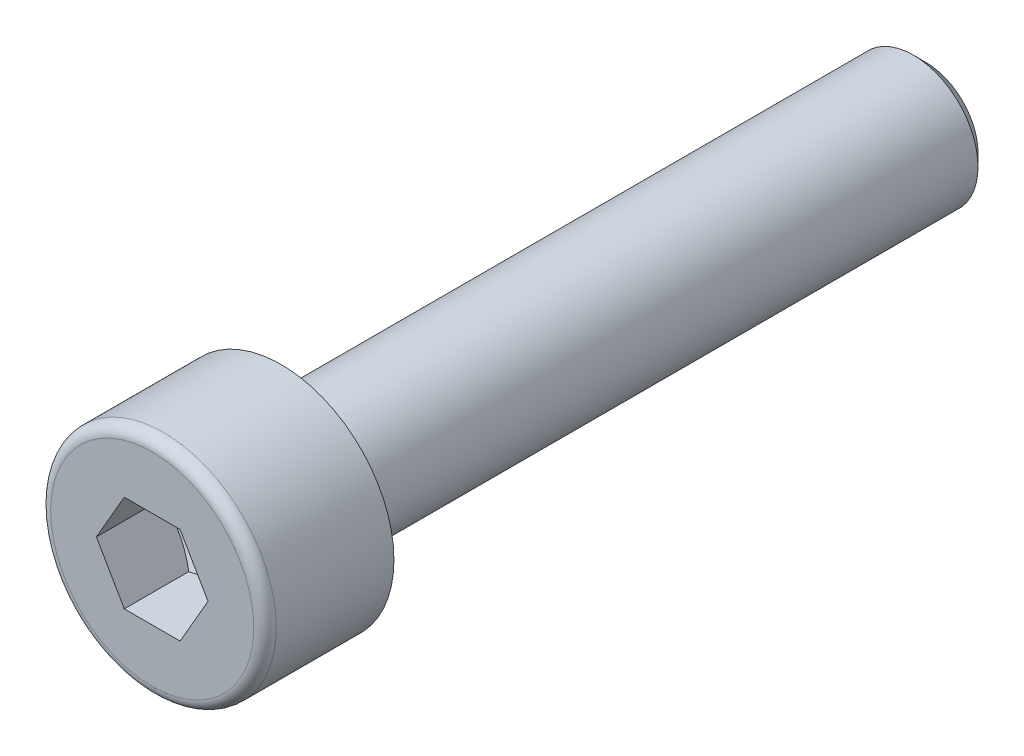
ISO-10303-21;
HEADER;
FILE_DESCRIPTION(('STEP AP214'),'2;1');
FILE_NAME('part.step','',(''),(''),'','','');
FILE_SCHEMA(('AUTOMOTIVE_DESIGN { 1 0 10303 214 1 1 1 1 }'));
ENDSEC;
DATA;
#1=APPLICATION_CONTEXT('core data for automotive mechanical design processes');
#2=APPLICATION_PROTOCOL_DEFINITION('international standard','automotive_design',2000,#1);
#3=PRODUCT_CONTEXT('',#1,'mechanical');
#4=PRODUCT('Part','Part','',(#3));
#5=PRODUCT_RELATED_PRODUCT_CATEGORY('part','',(#4));
#6=PRODUCT_DEFINITION_FORMATION('','',#4);
#7=PRODUCT_DEFINITION_CONTEXT('part definition',#1,'design');
#8=PRODUCT_DEFINITION('design','',#6,#7);
#9=PRODUCT_DEFINITION_SHAPE('','',#8);
#10=(LENGTH_UNIT() NAMED_UNIT(*) SI_UNIT(.MILLI.,.METRE.));
#11=(NAMED_UNIT(*) PLANE_ANGLE_UNIT() SI_UNIT($,.RADIAN.));
#12=(NAMED_UNIT(*) SI_UNIT($,.STERADIAN.) SOLID_ANGLE_UNIT());
#13=UNCERTAINTY_MEASURE_WITH_UNIT(LENGTH_MEASURE(1.E-05),#10,'distance_accuracy_value','');
#14=(GEOMETRIC_REPRESENTATION_CONTEXT(3) GLOBAL_UNCERTAINTY_ASSIGNED_CONTEXT((#13)) GLOBAL_UNIT_ASSIGNED_CONTEXT((#10,
#11,#12)) REPRESENTATION_CONTEXT('',''));
#15=CARTESIAN_POINT('',(0.,0.,0.));
#16=DIRECTION('',(0.,0.,1.));
#17=DIRECTION('',(1.,0.,0.));
#18=AXIS2_PLACEMENT_3D('',#15,#16,#17);
#19=CARTESIAN_POINT('',(0.,0.,0.));
#20=DIRECTION('',(0.,0.,1.));
#21=DIRECTION('',(1.,0.,0.));
#22=AXIS2_PLACEMENT_3D('',#19,#20,#21);
#23=PLANE('',#22);
#24=CARTESIAN_POINT('',(0.,0.,0.));
#25=DIRECTION('',(0.,0.,1.));
#26=DIRECTION('',(1.,0.,0.));
#27=AXIS2_PLACEMENT_3D('',#24,#25,#26);
#28=CIRCLE('',#27,3.5);
#29=CARTESIAN_POINT('',(3.5,0.,0.));
#30=VERTEX_POINT('',#29);
#31=EDGE_CURVE('E146',#30,#30,#28,.T.);
#32=ORIENTED_EDGE('',*,*,#31,.F.);
#33=EDGE_LOOP('',(#32));
#34=FACE_BOUND('',#33,.T.);
#35=CARTESIAN_POINT('',(0.,0.,0.));
#36=DIRECTION('',(0.,0.,1.));
#37=DIRECTION('',(1.,0.,0.));
#38=AXIS2_PLACEMENT_3D('',#35,#36,#37);
#39=CIRCLE('',#38,2.);
#40=CARTESIAN_POINT('',(2.,0.,0.));
#41=VERTEX_POINT('',#40);
#42=EDGE_CURVE('E151',#41,#41,#39,.F.);
#43=ORIENTED_EDGE('',*,*,#42,.F.);
#44=EDGE_LOOP('',(#43));
#45=FACE_BOUND('',#44,.T.);
#46=ADVANCED_FACE('F43',(#34,#45),#23,.F.);
#47=CARTESIAN_POINT('',(0.,3.15,4.));
#48=DIRECTION('',(0.,0.,-1.));
#49=DIRECTION('',(-1.,0.,0.));
#50=AXIS2_PLACEMENT_3D('',#47,#48,#49);
#51=PLANE('',#50);
#52=CARTESIAN_POINT('',(0.,0.,4.));
#53=DIRECTION('',(0.,0.,-1.));
#54=DIRECTION('',(-1.,0.,0.));
#55=AXIS2_PLACEMENT_3D('',#52,#53,#54);
#56=CIRCLE('',#55,3.15);
#57=CARTESIAN_POINT('',(-3.15,0.,4.));
#58=VERTEX_POINT('',#57);
#59=EDGE_CURVE('E51',#58,#58,#56,.F.);
#60=ORIENTED_EDGE('',*,*,#59,.T.);
#61=EDGE_LOOP('',(#60));
#62=FACE_BOUND('',#61,.T.);
#63=DIRECTION('',(0.5,-0.866025403784438,0.));
#64=VECTOR('',#63,1.);
#65=CARTESIAN_POINT('',(0.866025,1.49999930062484,4.));
#66=LINE('',#65,#64);
#67=CARTESIAN_POINT('',(0.866025,1.49999930062484,4.));
#68=VERTEX_POINT('',#67);
#69=CARTESIAN_POINT('',(1.73205,0.,4.));
#70=VERTEX_POINT('',#69);
#71=EDGE_CURVE('E58',#68,#70,#66,.T.);
#72=ORIENTED_EDGE('',*,*,#71,.T.);
#73=DIRECTION('',(-0.5,-0.866025403784439,0.));
#74=VECTOR('',#73,1.);
#75=CARTESIAN_POINT('',(1.73205,0.,4.));
#76=LINE('',#75,#74);
#77=CARTESIAN_POINT('',(0.866025,-1.49999930062484,4.));
#78=VERTEX_POINT('',#77);
#79=EDGE_CURVE('E175',#70,#78,#76,.T.);
#80=ORIENTED_EDGE('',*,*,#79,.T.);
#81=DIRECTION('',(-1.,0.,0.));
#82=VECTOR('',#81,1.);
#83=CARTESIAN_POINT('',(0.866025,-1.49999930062484,4.));
#84=LINE('',#83,#82);
#85=CARTESIAN_POINT('',(-0.866025,-1.49999930062484,4.));
#86=VERTEX_POINT('',#85);
#87=EDGE_CURVE('E271',#78,#86,#84,.T.);
#88=ORIENTED_EDGE('',*,*,#87,.T.);
#89=DIRECTION('',(-0.5,0.866025403784439,0.));
#90=VECTOR('',#89,1.);
#91=CARTESIAN_POINT('',(-0.866025,-1.49999930062484,4.));
#92=LINE('',#91,#90);
#93=CARTESIAN_POINT('',(-1.73205,0.,4.));
#94=VERTEX_POINT('',#93);
#95=EDGE_CURVE('E275',#86,#94,#92,.T.);
#96=ORIENTED_EDGE('',*,*,#95,.T.);
#97=DIRECTION('',(0.5,0.866025403784439,0.));
#98=VECTOR('',#97,1.);
#99=CARTESIAN_POINT('',(-1.73205,0.,4.));
#100=LINE('',#99,#98);
#101=CARTESIAN_POINT('',(-0.866025,1.49999930062484,4.));
#102=VERTEX_POINT('',#101);
#103=EDGE_CURVE('E130',#94,#102,#100,.T.);
#104=ORIENTED_EDGE('',*,*,#103,.T.);
#105=DIRECTION('',(1.,0.,0.));
#106=VECTOR('',#105,1.);
#107=CARTESIAN_POINT('',(-0.866025,1.49999930062484,4.));
#108=LINE('',#107,#106);
#109=EDGE_CURVE('E122',#102,#68,#108,.T.);
#110=ORIENTED_EDGE('',*,*,#109,.T.);
#111=EDGE_LOOP('',(#72,#80,#88,#96,#104,#110));
#112=FACE_BOUND('',#111,.T.);
#113=ADVANCED_FACE('F230',(#62,#112),#51,.F.);
#114=CARTESIAN_POINT('',(0.,0.,4.));
#115=DIRECTION('',(0.,0.,1.));
#116=DIRECTION('',(1.,0.,0.));
#117=AXIS2_PLACEMENT_3D('',#114,#115,#116);
#118=CYLINDRICAL_SURFACE('',#117,3.5);
#119=CARTESIAN_POINT('',(0.,0.,3.65));
#120=DIRECTION('',(0.,0.,-1.));
#121=DIRECTION('',(-1.,0.,0.));
#122=AXIS2_PLACEMENT_3D('',#119,#120,#121);
#123=CIRCLE('',#122,3.5);
#124=CARTESIAN_POINT('',(-3.5,0.,3.65));
#125=VERTEX_POINT('',#124);
#126=EDGE_CURVE('E12',#125,#125,#123,.T.);
#127=ORIENTED_EDGE('',*,*,#126,.T.);
#128=EDGE_LOOP('',(#127));
#129=FACE_BOUND('',#128,.T.);
#130=ORIENTED_EDGE('',*,*,#31,.T.);
#131=EDGE_LOOP('',(#130));
#132=FACE_BOUND('',#131,.T.);
#133=ADVANCED_FACE('F228',(#129,#132),#118,.T.);
#134=CARTESIAN_POINT('',(0.866025,1.49999930062484,1.00000046625011));
#135=DIRECTION('',(-0.866025403784438,-0.5,0.));
#136=DIRECTION('',(-0.5,0.866025403784438,0.));
#137=AXIS2_PLACEMENT_3D('',#134,#135,#136);
#138=PLANE('',#137);
#139=DIRECTION('',(0.,0.,1.));
#140=VECTOR('',#139,1.);
#141=CARTESIAN_POINT('',(1.73205,0.,1.00000046625011));
#142=LINE('',#141,#140);
#143=CARTESIAN_POINT('',(1.73205,0.,2.));
#144=VERTEX_POINT('',#143);
#145=EDGE_CURVE('E143',#144,#70,#142,.T.);
#146=ORIENTED_EDGE('',*,*,#145,.T.);
#147=ORIENTED_EDGE('',*,*,#71,.F.);
#148=DIRECTION('',(0.,0.,1.));
#149=VECTOR('',#148,1.);
#150=CARTESIAN_POINT('',(0.866025,1.49999930062484,1.00000046625011));
#151=LINE('',#150,#149);
#152=CARTESIAN_POINT('',(0.866025,1.49999930062484,2.));
#153=VERTEX_POINT('',#152);
#154=EDGE_CURVE('E115',#153,#68,#151,.T.);
#155=ORIENTED_EDGE('',*,*,#154,.F.);
#156=CARTESIAN_POINT('',(1.73205115470054,-2.E-06,2.00000066666734));
#157=CARTESIAN_POINT('',(1.69399458130122,0.0659139186895892,1.97802228100261));
#158=CARTESIAN_POINT('',(1.65560950414464,0.132398822577242,1.95803408114054));
#159=CARTESIAN_POINT('',(1.57817473630843,0.266519774741864,1.92314525941874));
#160=CARTESIAN_POINT('',(1.53912367019894,0.334158205333232,1.90825697858766));
#161=CARTESIAN_POINT('',(1.46150547885139,0.468596856338784,1.88508226983918));
#162=CARTESIAN_POINT('',(1.42295029290091,0.535376397300293,1.87664158385231));
#163=CARTESIAN_POINT('',(1.34565859846878,0.669249539059823,1.86656700525616));
#164=CARTESIAN_POINT('',(1.30692237073331,0.736342653591208,1.86492476807133));
#165=CARTESIAN_POINT('',(1.23454773253413,0.861699204131607,1.86834969801067));
#166=CARTESIAN_POINT('',(1.20089846229767,0.919981449818777,1.87257593125167));
#167=CARTESIAN_POINT('',(1.1338191361032,1.03616625092508,1.88596796669928));
#168=CARTESIAN_POINT('',(1.10038931198579,1.09406840478452,1.89513833923059));
#169=CARTESIAN_POINT('',(1.03317179328088,1.21049256234014,1.91806252128818));
#170=CARTESIAN_POINT('',(0.999392601793287,1.26899983823525,1.93191346069662));
#171=CARTESIAN_POINT('',(0.932337893068965,1.38514200063251,1.96334924731355));
#172=CARTESIAN_POINT('',(0.89906151743008,1.4427783739308,1.980926712986));
#173=CARTESIAN_POINT('',(0.866023845299461,1.50000130062484,2.00000066666734));
#174=B_SPLINE_CURVE_WITH_KNOTS('',3,(#156,#157,#158,#159,#160,#161,#162,#163,#164,#165,#166,
#167,#168,#169,#170,#171,#172,#173),.UNSPECIFIED.,.F.,.F.,(4,2,2,2,2,2,2,2,4),(0.,
0.237762055931485,0.476095461361748,0.708530837844131,0.94068083294838,1.14278193102308,
1.34507017093339,1.55184422617205,1.75821246569164),.UNSPECIFIED.);
#175=EDGE_CURVE('E107',#144,#153,#174,.T.);
#176=ORIENTED_EDGE('',*,*,#175,.F.);
#177=EDGE_LOOP('',(#146,#147,#155,#176));
#178=FACE_BOUND('',#177,.T.);
#179=ADVANCED_FACE('F116',(#178),#138,.T.);
#180=CARTESIAN_POINT('',(1.73205,0.,1.00000046625011));
#181=DIRECTION('',(-0.866025403784439,0.5,0.));
#182=DIRECTION('',(0.5,0.866025403784439,0.));
#183=AXIS2_PLACEMENT_3D('',#180,#181,#182);
#184=PLANE('',#183);
#185=DIRECTION('',(0.,0.,1.));
#186=VECTOR('',#185,1.);
#187=CARTESIAN_POINT('',(0.866025,-1.49999930062484,1.00000046625011));
#188=LINE('',#187,#186);
#189=CARTESIAN_POINT('',(0.866025,-1.49999930062484,2.));
#190=VERTEX_POINT('',#189);
#191=EDGE_CURVE('E140',#190,#78,#188,.T.);
#192=ORIENTED_EDGE('',*,*,#191,.T.);
#193=ORIENTED_EDGE('',*,*,#79,.F.);
#194=ORIENTED_EDGE('',*,*,#145,.F.);
#195=CARTESIAN_POINT('',(0.866023845299462,-1.50000130062484,2.00000066666734));
#196=CARTESIAN_POINT('',(0.904080418698778,-1.43408538193525,1.9780222810026));
#197=CARTESIAN_POINT('',(0.942465495855361,-1.36760047804759,1.95803408114054));
#198=CARTESIAN_POINT('',(1.01990026369157,-1.23347952588297,1.92314525941874));
#199=CARTESIAN_POINT('',(1.05895132980106,-1.1658410952916,1.90825697858766));
#200=CARTESIAN_POINT('',(1.13656952114861,-1.03140244428605,1.88508226983918));
#201=CARTESIAN_POINT('',(1.1751247070991,-0.964622903324544,1.87664158385231));
#202=CARTESIAN_POINT('',(1.25241640153122,-0.830749761565014,1.86656700525616));
#203=CARTESIAN_POINT('',(1.29115262926669,-0.763656647033629,1.86492476807133));
#204=CARTESIAN_POINT('',(1.36352726746587,-0.638300096493229,1.86834969801067));
#205=CARTESIAN_POINT('',(1.39717653770233,-0.58001785080606,1.87257593125166));
#206=CARTESIAN_POINT('',(1.4642558638968,-0.463833049699756,1.88596796669928));
#207=CARTESIAN_POINT('',(1.49768568801421,-0.405930895840313,1.89513833923059));
#208=CARTESIAN_POINT('',(1.56490320671912,-0.2895067382847,1.91806252128818));
#209=CARTESIAN_POINT('',(1.59868239820671,-0.230999462389588,1.93191346069662));
#210=CARTESIAN_POINT('',(1.66573710693103,-0.11485729999233,1.96334924731355));
#211=CARTESIAN_POINT('',(1.69901348256992,-0.0572209266940348,1.980926712986));
#212=CARTESIAN_POINT('',(1.73205115470054,1.99999999979098E-06,2.00000066666734));
#213=B_SPLINE_CURVE_WITH_KNOTS('',3,(#195,#196,#197,#198,#199,#200,#201,#202,#203,#204,#205,
#206,#207,#208,#209,#210,#211,#212),.UNSPECIFIED.,.F.,.F.,(4,2,2,2,2,2,2,2,4),(0.,
0.237762055931484,0.476095461361747,0.708530837844129,0.940680832948377,1.14278193102307,
1.34507017093338,1.55184422617205,1.75821246569164),.UNSPECIFIED.);
#214=EDGE_CURVE('E111',#190,#144,#213,.T.);
#215=ORIENTED_EDGE('',*,*,#214,.F.);
#216=EDGE_LOOP('',(#192,#193,#194,#215));
#217=FACE_BOUND('',#216,.T.);
#218=ADVANCED_FACE('F219',(#217),#184,.T.);
#219=CARTESIAN_POINT('',(0.866025,-1.49999930062484,1.00000046625011));
#220=DIRECTION('',(0.,1.,0.));
#221=DIRECTION('',(1.,0.,0.));
#222=AXIS2_PLACEMENT_3D('',#219,#220,#221);
#223=PLANE('',#222);
#224=DIRECTION('',(0.,0.,1.));
#225=VECTOR('',#224,1.);
#226=CARTESIAN_POINT('',(-0.866025,-1.49999930062484,1.00000046625011));
#227=LINE('',#226,#225);
#228=CARTESIAN_POINT('',(-0.866025,-1.49999930062484,2.));
#229=VERTEX_POINT('',#228);
#230=EDGE_CURVE('E137',#229,#86,#227,.T.);
#231=ORIENTED_EDGE('',*,*,#230,.T.);
#232=ORIENTED_EDGE('',*,*,#87,.F.);
#233=ORIENTED_EDGE('',*,*,#191,.F.);
#234=CARTESIAN_POINT('',(-2.24271663728987,-1.49999930062484,2.55775267344395));
#235=CARTESIAN_POINT('',(-2.17794141332338,-1.49999930062484,2.52667596135368));
#236=CARTESIAN_POINT('',(-2.11300852130655,-1.49999930062484,2.49592211621229));
#237=CARTESIAN_POINT('',(-1.98274303131292,-1.49999930062484,2.43524311162405));
#238=CARTESIAN_POINT('',(-1.91741036395219,-1.49999930062484,2.40531810131238));
#239=CARTESIAN_POINT('',(-1.78588635397686,-1.49999930062484,2.34631254095844));
#240=CARTESIAN_POINT('',(-1.71969220663993,-1.49999930062484,2.31723821458641));
#241=CARTESIAN_POINT('',(-1.58674953026847,-1.49999930062484,2.26039396688304));
#242=CARTESIAN_POINT('',(-1.52000103027226,-1.49999930062484,2.23262397772829));
#243=CARTESIAN_POINT('',(-1.38408036083489,-1.49999930062484,2.17802545642731));
#244=CARTESIAN_POINT('',(-1.31489044686774,-1.49999930062484,2.1512405113674));
#245=CARTESIAN_POINT('',(-1.17568875836751,-1.49999930062484,2.09990652822181));
#246=CARTESIAN_POINT('',(-1.10567688208708,-1.49999930062484,2.07535777031023));
#247=CARTESIAN_POINT('',(-0.894522216300188,-1.49999930062484,2.0061010834001));
#248=CARTESIAN_POINT('',(-0.751873977094198,-1.49999930062484,1.9656202744164));
#249=CARTESIAN_POINT('',(-0.535047450977606,-1.49999930062484,1.9186645261203));
#250=CARTESIAN_POINT('',(-0.462365424606466,-1.49999930062484,1.90531291688069));
#251=CARTESIAN_POINT('',(-0.316183762847225,-1.49999930062484,1.8841134767258));
#252=CARTESIAN_POINT('',(-0.242684183051902,-1.49999930062484,1.87626527388084));
#253=CARTESIAN_POINT('',(-0.0961588910059515,-1.49999930062484,1.86679859934064));
#254=CARTESIAN_POINT('',(-0.0231380525234333,-1.49999930062484,1.86510661239957));
#255=CARTESIAN_POINT('',(0.122783022434076,-1.49999930062484,1.86789948707645));
#256=CARTESIAN_POINT('',(0.195683251161583,-1.49999930062484,1.8723847311637));
#257=CARTESIAN_POINT('',(0.375553746438775,-1.49999930062484,1.89067768491976));
#258=CARTESIAN_POINT('',(0.4821754471692,-1.49999930062484,1.90791354190592));
#259=CARTESIAN_POINT('',(0.693345462539466,-1.49999930062484,1.95235984396466));
#260=CARTESIAN_POINT('',(0.79789111749796,-1.49999930062484,1.97958231080908));
#261=CARTESIAN_POINT('',(0.954250638010105,-1.49999930062484,2.02608493590371));
#262=CARTESIAN_POINT('',(1.00687274480645,-1.49999930062484,2.04274751774646));
#263=CARTESIAN_POINT('',(1.11156919647057,-1.49999930062484,2.07761406562061));
#264=CARTESIAN_POINT('',(1.16364386068557,-1.49999930062484,2.09581706970924));
#265=CARTESIAN_POINT('',(1.26731501755411,-1.49999930062484,2.13350010092581));
#266=CARTESIAN_POINT('',(1.31891159517315,-1.49999930062484,2.15297989597396));
#267=CARTESIAN_POINT('',(1.42169818698628,-1.49999930062484,2.19300580386973));
#268=CARTESIAN_POINT('',(1.47288813079445,-1.49999930062484,2.21355209687612));
#269=CARTESIAN_POINT('',(1.6035520536722,-1.49999930062484,2.26731329701247));
#270=CARTESIAN_POINT('',(1.68276476914258,-1.49999930062484,2.30116251352867));
#271=CARTESIAN_POINT('',(1.84047488481565,-1.49999930062484,2.37049266735));
#272=CARTESIAN_POINT('',(1.9189722309026,-1.49999930062484,2.40597372689195));
#273=CARTESIAN_POINT('',(2.15362957255391,-1.49999930062484,2.51428942992019));
#274=CARTESIAN_POINT('',(2.3089286607519,-1.49999930062484,2.58898549353906));
#275=CARTESIAN_POINT('',(2.61820006623532,-1.49999930062484,2.74151036059574));
#276=CARTESIAN_POINT('',(2.77217051778771,-1.49999930062484,2.81934290231597));
#277=CARTESIAN_POINT('',(3.07905650209162,-1.49999930062484,2.97700931547993));
#278=CARTESIAN_POINT('',(3.23197216581148,-1.49999930062484,3.05684293253984));
#279=CARTESIAN_POINT('',(3.52267476728495,-1.49999930062484,3.21028853935711));
#280=CARTESIAN_POINT('',(3.66052737206612,-1.49999930062484,3.28377655462836));
#281=CARTESIAN_POINT('',(3.93578914881928,-1.49999930062484,3.43158990958268));
#282=CARTESIAN_POINT('',(4.07319830413762,-1.49999930062484,3.50591528025237));
#283=CARTESIAN_POINT('',(4.34732590427536,-1.49999930062483,3.65500351537988));
#284=CARTESIAN_POINT('',(4.48404521696312,-1.49999930062483,3.72976478622522));
#285=CARTESIAN_POINT('',(4.75720742747683,-1.49999930062483,3.87977391809883));
#286=CARTESIAN_POINT('',(4.89365033939364,-1.49999930062484,3.9550217534582));
#287=CARTESIAN_POINT('',(5.02999394665514,-1.49999930062484,4.03044801324502));
#288=B_SPLINE_CURVE_WITH_KNOTS('',3,(#234,#235,#236,#237,#238,#239,#240,#241,#242,#243,#244,
#245,#246,#247,#248,#249,#250,#251,#252,#253,#254,#255,#256,#257,#258,#259,#260,#261,#262,#263,
#264,#265,#266,#267,#268,#269,#270,#271,#272,#273,#274,#275,#276,#277,#278,#279,#280,#281,#282,
#283,#284,#285,#286,#287),.UNSPECIFIED.,.F.,.F.,(4,2,2,2,2,2,2,2,2,2,2,2,2,2,2,2,2,2,2,2,2,2,2,
2,2,2,4),(0.,0.215535408976475,0.431109351318747,0.647990972858705,0.864861304394723,
1.08740082372431,1.30996818700982,1.75384735851117,1.97537373294937,2.19688513480997,
2.41574248382684,2.63461338422016,2.95796620171825,3.28170955197757,3.44728283297626,
3.61275347131505,3.77819411534645,3.94366279806486,4.20206179692704,4.46048018336434,
4.97740230798824,5.49495989978084,6.01245202818902,6.48110050133562,6.94976637432356,
7.41724019162004,7.88468954517039),.UNSPECIFIED.);
#289=EDGE_CURVE('E208',#229,#190,#288,.T.);
#290=ORIENTED_EDGE('',*,*,#289,.F.);
#291=EDGE_LOOP('',(#231,#232,#233,#290));
#292=FACE_BOUND('',#291,.T.);
#293=ADVANCED_FACE('F215',(#292),#223,.T.);
#294=CARTESIAN_POINT('',(-0.866025,-1.49999930062484,1.00000046625011));
#295=DIRECTION('',(0.866025403784439,0.5,0.));
#296=DIRECTION('',(0.5,-0.866025403784439,0.));
#297=AXIS2_PLACEMENT_3D('',#294,#295,#296);
#298=PLANE('',#297);
#299=DIRECTION('',(0.,0.,1.));
#300=VECTOR('',#299,1.);
#301=CARTESIAN_POINT('',(-1.73205,0.,1.00000046625011));
#302=LINE('',#301,#300);
#303=CARTESIAN_POINT('',(-1.73205,0.,2.));
#304=VERTEX_POINT('',#303);
#305=EDGE_CURVE('E128',#304,#94,#302,.T.);
#306=ORIENTED_EDGE('',*,*,#305,.T.);
#307=ORIENTED_EDGE('',*,*,#95,.F.);
#308=ORIENTED_EDGE('',*,*,#230,.F.);
#309=CARTESIAN_POINT('',(-1.73205115470054,1.99999999935948E-06,2.00000066666734));
#310=CARTESIAN_POINT('',(-1.69399458130122,-0.0659139186895897,1.97802228100261));
#311=CARTESIAN_POINT('',(-1.65560950414464,-0.132398822577242,1.95803408114054));
#312=CARTESIAN_POINT('',(-1.57817473630843,-0.266519774741865,1.92314525941874));
#313=CARTESIAN_POINT('',(-1.53912367019894,-0.334158205333233,1.90825697858766));
#314=CARTESIAN_POINT('',(-1.46150547885139,-0.468596856338785,1.88508226983918));
#315=CARTESIAN_POINT('',(-1.4229502929009,-0.535376397300293,1.87664158385231));
#316=CARTESIAN_POINT('',(-1.34565859846878,-0.669249539059823,1.86656700525616));
#317=CARTESIAN_POINT('',(-1.30692237073331,-0.736342653591209,1.86492476807133));
#318=CARTESIAN_POINT('',(-1.23454773253413,-0.861699204131608,1.86834969801067));
#319=CARTESIAN_POINT('',(-1.20089846229767,-0.919981449818777,1.87257593125166));
#320=CARTESIAN_POINT('',(-1.1338191361032,-1.03616625092508,1.88596796669928));
#321=CARTESIAN_POINT('',(-1.10038931198579,-1.09406840478452,1.89513833923059));
#322=CARTESIAN_POINT('',(-1.03317179328088,-1.21049256234014,1.91806252128818));
#323=CARTESIAN_POINT('',(-0.999392601793289,-1.26899983823525,1.93191346069662));
#324=CARTESIAN_POINT('',(-0.932337893068967,-1.38514200063251,1.96334924731355));
#325=CARTESIAN_POINT('',(-0.899061517430081,-1.4427783739308,1.980926712986));
#326=CARTESIAN_POINT('',(-0.866023845299461,-1.50000130062484,2.00000066666734));
#327=B_SPLINE_CURVE_WITH_KNOTS('',3,(#309,#310,#311,#312,#313,#314,#315,#316,#317,#318,#319,
#320,#321,#322,#323,#324,#325,#326),.UNSPECIFIED.,.F.,.F.,(4,2,2,2,2,2,2,2,4),(0.,
0.237762055931485,0.476095461361749,0.708530837844132,0.94068083294838,1.14278193102308,
1.34507017093338,1.55184422617205,1.75821246569164),.UNSPECIFIED.);
#328=EDGE_CURVE('E202',#304,#229,#327,.T.);
#329=ORIENTED_EDGE('',*,*,#328,.F.);
#330=EDGE_LOOP('',(#306,#307,#308,#329));
#331=FACE_BOUND('',#330,.T.);
#332=ADVANCED_FACE('F218',(#331),#298,.T.);
#333=CARTESIAN_POINT('',(-1.73205,0.,1.00000046625011));
#334=DIRECTION('',(0.866025403784439,-0.5,0.));
#335=DIRECTION('',(-0.5,-0.866025403784439,0.));
#336=AXIS2_PLACEMENT_3D('',#333,#334,#335);
#337=PLANE('',#336);
#338=DIRECTION('',(0.,0.,1.));
#339=VECTOR('',#338,1.);
#340=CARTESIAN_POINT('',(-0.866025,1.49999930062484,1.00000046625011));
#341=LINE('',#340,#339);
#342=CARTESIAN_POINT('',(-0.866025,1.49999930062484,2.));
#343=VERTEX_POINT('',#342);
#344=EDGE_CURVE('E121',#343,#102,#341,.T.);
#345=ORIENTED_EDGE('',*,*,#344,.T.);
#346=ORIENTED_EDGE('',*,*,#103,.F.);
#347=ORIENTED_EDGE('',*,*,#305,.F.);
#348=CARTESIAN_POINT('',(-0.866023845299462,1.50000130062484,2.00000066666734));
#349=CARTESIAN_POINT('',(-0.904080418698778,1.43408538193525,1.9780222810026));
#350=CARTESIAN_POINT('',(-0.942465495855361,1.36760047804759,1.95803408114054));
#351=CARTESIAN_POINT('',(-1.01990026369157,1.23347952588297,1.92314525941874));
#352=CARTESIAN_POINT('',(-1.05895132980106,1.1658410952916,1.90825697858766));
#353=CARTESIAN_POINT('',(-1.13656952114861,1.03140244428605,1.88508226983918));
#354=CARTESIAN_POINT('',(-1.1751247070991,0.964622903324544,1.87664158385231));
#355=CARTESIAN_POINT('',(-1.25241640153122,0.830749761565014,1.86656700525616));
#356=CARTESIAN_POINT('',(-1.29115262926669,0.763656647033629,1.86492476807133));
#357=CARTESIAN_POINT('',(-1.36352726746587,0.638300096493229,1.86834969801067));
#358=CARTESIAN_POINT('',(-1.39717653770233,0.58001785080606,1.87257593125166));
#359=CARTESIAN_POINT('',(-1.4642558638968,0.463833049699756,1.88596796669928));
#360=CARTESIAN_POINT('',(-1.49768568801421,0.405930895840313,1.89513833923059));
#361=CARTESIAN_POINT('',(-1.56490320671912,0.289506738284699,1.91806252128818));
#362=CARTESIAN_POINT('',(-1.59868239820671,0.230999462389588,1.93191346069662));
#363=CARTESIAN_POINT('',(-1.66573710693103,0.11485729999233,1.96334924731355));
#364=CARTESIAN_POINT('',(-1.69901348256992,0.0572209266940344,1.980926712986));
#365=CARTESIAN_POINT('',(-1.73205115470054,-2.00000000048508E-06,2.00000066666734));
#366=B_SPLINE_CURVE_WITH_KNOTS('',3,(#348,#349,#350,#351,#352,#353,#354,#355,#356,#357,#358,
#359,#360,#361,#362,#363,#364,#365),.UNSPECIFIED.,.F.,.F.,(4,2,2,2,2,2,2,2,4),(0.,
0.237762055931484,0.476095461361747,0.708530837844129,0.940680832948377,1.14278193102307,
1.34507017093338,1.55184422617205,1.75821246569164),.UNSPECIFIED.);
#367=EDGE_CURVE('E66',#343,#304,#366,.T.);
#368=ORIENTED_EDGE('',*,*,#367,.F.);
#369=EDGE_LOOP('',(#345,#346,#347,#368));
#370=FACE_BOUND('',#369,.T.);
#371=ADVANCED_FACE('F297',(#370),#337,.T.);
#372=CARTESIAN_POINT('',(-0.866025,1.49999930062484,1.00000046625011));
#373=DIRECTION('',(0.,-1.,0.));
#374=DIRECTION('',(-1.,0.,0.));
#375=AXIS2_PLACEMENT_3D('',#372,#373,#374);
#376=PLANE('',#375);
#377=ORIENTED_EDGE('',*,*,#154,.T.);
#378=ORIENTED_EDGE('',*,*,#109,.F.);
#379=ORIENTED_EDGE('',*,*,#344,.F.);
#380=CARTESIAN_POINT('',(-2.24271663728987,1.49999930062484,2.55775267344395));
#381=CARTESIAN_POINT('',(-2.17794141332338,1.49999930062484,2.52667596135368));
#382=CARTESIAN_POINT('',(-2.11300852130655,1.49999930062484,2.49592211621229));
#383=CARTESIAN_POINT('',(-1.98274303131292,1.49999930062484,2.43524311162405));
#384=CARTESIAN_POINT('',(-1.91741036395219,1.49999930062484,2.40531810131238));
#385=CARTESIAN_POINT('',(-1.78588635397687,1.49999930062484,2.34631254095844));
#386=CARTESIAN_POINT('',(-1.71969220663993,1.49999930062484,2.31723821458641));
#387=CARTESIAN_POINT('',(-1.58674953026847,1.49999930062484,2.26039396688304));
#388=CARTESIAN_POINT('',(-1.52000103027226,1.49999930062484,2.23262397772829));
#389=CARTESIAN_POINT('',(-1.3840803608349,1.49999930062484,2.17802545642731));
#390=CARTESIAN_POINT('',(-1.31489044686775,1.49999930062484,2.1512405113674));
#391=CARTESIAN_POINT('',(-1.17568875836751,1.49999930062484,2.09990652822181));
#392=CARTESIAN_POINT('',(-1.10567688208708,1.49999930062484,2.07535777031023));
#393=CARTESIAN_POINT('',(-0.894522216300189,1.49999930062484,2.0061010834001));
#394=CARTESIAN_POINT('',(-0.751873977094199,1.49999930062484,1.9656202744164));
#395=CARTESIAN_POINT('',(-0.535047450977607,1.49999930062484,1.9186645261203));
#396=CARTESIAN_POINT('',(-0.462365424606467,1.49999930062484,1.90531291688069));
#397=CARTESIAN_POINT('',(-0.316183762847226,1.49999930062484,1.8841134767258));
#398=CARTESIAN_POINT('',(-0.242684183051903,1.49999930062484,1.87626527388084));
#399=CARTESIAN_POINT('',(-0.0961588910059524,1.49999930062484,1.86679859934064));
#400=CARTESIAN_POINT('',(-0.0231380525234342,1.49999930062484,1.86510661239957));
#401=CARTESIAN_POINT('',(0.122783022434075,1.49999930062484,1.86789948707645));
#402=CARTESIAN_POINT('',(0.195683251161582,1.49999930062484,1.8723847311637));
#403=CARTESIAN_POINT('',(0.375553746438774,1.49999930062484,1.89067768491976));
#404=CARTESIAN_POINT('',(0.482175447169199,1.49999930062484,1.90791354190592));
#405=CARTESIAN_POINT('',(0.693345462539464,1.49999930062484,1.95235984396466));
#406=CARTESIAN_POINT('',(0.797891117497957,1.49999930062484,1.97958231080908));
#407=CARTESIAN_POINT('',(0.954250638010102,1.49999930062484,2.02608493590371));
#408=CARTESIAN_POINT('',(1.00687274480645,1.49999930062484,2.04274751774646));
#409=CARTESIAN_POINT('',(1.11156919647056,1.49999930062484,2.07761406562061));
#410=CARTESIAN_POINT('',(1.16364386068556,1.49999930062484,2.09581706970924));
#411=CARTESIAN_POINT('',(1.2673150175541,1.49999930062484,2.13350010092581));
#412=CARTESIAN_POINT('',(1.31891159517315,1.49999930062484,2.15297989597396));
#413=CARTESIAN_POINT('',(1.42169818698628,1.49999930062484,2.19300580386972));
#414=CARTESIAN_POINT('',(1.47288813079445,1.49999930062484,2.21355209687612));
#415=CARTESIAN_POINT('',(1.60355205367219,1.49999930062484,2.26731329701247));
#416=CARTESIAN_POINT('',(1.68276476914257,1.49999930062484,2.30116251352867));
#417=CARTESIAN_POINT('',(1.84047488481565,1.49999930062484,2.37049266735));
#418=CARTESIAN_POINT('',(1.91897223090259,1.49999930062484,2.40597372689195));
#419=CARTESIAN_POINT('',(2.15362957255391,1.49999930062484,2.51428942992019));
#420=CARTESIAN_POINT('',(2.30892866075189,1.49999930062484,2.58898549353906));
#421=CARTESIAN_POINT('',(2.61820006623532,1.49999930062484,2.74151036059574));
#422=CARTESIAN_POINT('',(2.77217051778771,1.49999930062484,2.81934290231597));
#423=CARTESIAN_POINT('',(3.07905650209162,1.49999930062484,2.97700931547993));
#424=CARTESIAN_POINT('',(3.23197216581148,1.49999930062484,3.05684293253984));
#425=CARTESIAN_POINT('',(3.52267476728495,1.49999930062484,3.21028853935711));
#426=CARTESIAN_POINT('',(3.66052737206611,1.49999930062484,3.28377655462836));
#427=CARTESIAN_POINT('',(3.93578914881928,1.49999930062484,3.43158990958268));
#428=CARTESIAN_POINT('',(4.07319830413762,1.49999930062484,3.50591528025237));
#429=CARTESIAN_POINT('',(4.34732590427536,1.49999930062484,3.65500351537988));
#430=CARTESIAN_POINT('',(4.48404521696312,1.49999930062484,3.72976478622523));
#431=CARTESIAN_POINT('',(4.75720742747683,1.49999930062484,3.87977391809883));
#432=CARTESIAN_POINT('',(4.89365033939364,1.49999930062484,3.9550217534582));
#433=CARTESIAN_POINT('',(5.02999394665514,1.49999930062484,4.03044801324502));
#434=B_SPLINE_CURVE_WITH_KNOTS('',3,(#380,#381,#382,#383,#384,#385,#386,#387,#388,#389,#390,
#391,#392,#393,#394,#395,#396,#397,#398,#399,#400,#401,#402,#403,#404,#405,#406,#407,#408,#409,
#410,#411,#412,#413,#414,#415,#416,#417,#418,#419,#420,#421,#422,#423,#424,#425,#426,#427,#428,
#429,#430,#431,#432,#433),.UNSPECIFIED.,.F.,.F.,(4,2,2,2,2,2,2,2,2,2,2,2,2,2,2,2,2,2,2,2,2,2,2,
2,2,2,4),(0.,0.215535408976474,0.431109351318746,0.647990972858704,0.864861304394721,
1.0874008237243,1.30996818700982,1.75384735851117,1.97537373294937,2.19688513480997,
2.41574248382684,2.63461338422015,2.95796620171825,3.28170955197757,3.44728283297626,
3.61275347131505,3.77819411534645,3.94366279806485,4.20206179692704,4.46048018336433,
4.97740230798824,5.49495989978084,6.01245202818902,6.48110050133561,6.94976637432355,
7.41724019162004,7.88468954517039),.UNSPECIFIED.);
#435=EDGE_CURVE('E108',#153,#343,#434,.F.);
#436=ORIENTED_EDGE('',*,*,#435,.F.);
#437=EDGE_LOOP('',(#377,#378,#379,#436));
#438=FACE_BOUND('',#437,.T.);
#439=ADVANCED_FACE('F103',(#438),#376,.T.);
#440=CARTESIAN_POINT('',(0.,0.,1.00000046625011));
#441=DIRECTION('',(0.,0.,1.));
#442=DIRECTION('',(1.,0.,0.));
#443=AXIS2_PLACEMENT_3D('',#440,#441,#442);
#444=CONICAL_SURFACE('',#443,0.,1.0471975511966);
#445=CARTESIAN_POINT('',(0.,0.,1.00000046625011));
#446=VERTEX_POINT('',#445);
#447=VERTEX_LOOP('',#446);
#448=FACE_BOUND('',#447,.T.);
#449=ORIENTED_EDGE('',*,*,#175,.T.);
#450=ORIENTED_EDGE('',*,*,#435,.T.);
#451=ORIENTED_EDGE('',*,*,#367,.T.);
#452=ORIENTED_EDGE('',*,*,#328,.T.);
#453=ORIENTED_EDGE('',*,*,#289,.T.);
#454=ORIENTED_EDGE('',*,*,#214,.T.);
#455=EDGE_LOOP('',(#449,#450,#451,#452,#453,#454));
#456=FACE_BOUND('',#455,.T.);
#457=ADVANCED_FACE('F99',(#448,#456),#444,.F.);
#458=CARTESIAN_POINT('',(0.,0.,-20.));
#459=DIRECTION('',(0.,0.,1.));
#460=DIRECTION('',(1.,0.,0.));
#461=AXIS2_PLACEMENT_3D('',#458,#459,#460);
#462=CYLINDRICAL_SURFACE('',#461,2.);
#463=CARTESIAN_POINT('',(0.,0.,-19.621125));
#464=DIRECTION('',(0.,0.,-1.));
#465=DIRECTION('',(-1.,0.,0.));
#466=AXIS2_PLACEMENT_3D('',#463,#464,#465);
#467=CIRCLE('',#466,2.);
#468=CARTESIAN_POINT('',(-2.,0.,-19.621125));
#469=VERTEX_POINT('',#468);
#470=EDGE_CURVE('E253',#469,#469,#467,.F.);
#471=ORIENTED_EDGE('',*,*,#470,.T.);
#472=EDGE_LOOP('',(#471));
#473=FACE_BOUND('',#472,.T.);
#474=ORIENTED_EDGE('',*,*,#42,.T.);
#475=EDGE_LOOP('',(#474));
#476=FACE_BOUND('',#475,.T.);
#477=ADVANCED_FACE('F102',(#473,#476),#462,.T.);
#478=CARTESIAN_POINT('',(0.,0.,-20.));
#479=DIRECTION('',(0.,0.,-1.));
#480=DIRECTION('',(-1.,0.,0.));
#481=AXIS2_PLACEMENT_3D('',#478,#479,#480);
#482=PLANE('',#481);
#483=CARTESIAN_POINT('',(0.,0.,-20.));
#484=DIRECTION('',(0.,0.,-1.));
#485=DIRECTION('',(-1.,0.,0.));
#486=AXIS2_PLACEMENT_3D('',#483,#484,#485);
#487=CIRCLE('',#486,1.62112500000001);
#488=CARTESIAN_POINT('',(-1.62112500000001,0.,-20.));
#489=VERTEX_POINT('',#488);
#490=EDGE_CURVE('E256',#489,#489,#487,.T.);
#491=ORIENTED_EDGE('',*,*,#490,.T.);
#492=EDGE_LOOP('',(#491));
#493=FACE_BOUND('',#492,.T.);
#494=ADVANCED_FACE('F242',(#493),#482,.T.);
#495=CARTESIAN_POINT('',(0.,0.,-20.));
#496=DIRECTION('',(0.,0.,1.));
#497=DIRECTION('',(1.,0.,0.));
#498=AXIS2_PLACEMENT_3D('',#495,#496,#497);
#499=CONICAL_SURFACE('',#498,1.62112500000001,0.785398163397441);
#500=ORIENTED_EDGE('',*,*,#470,.F.);
#501=EDGE_LOOP('',(#500));
#502=FACE_BOUND('',#501,.T.);
#503=ORIENTED_EDGE('',*,*,#490,.F.);
#504=EDGE_LOOP('',(#503));
#505=FACE_BOUND('',#504,.T.);
#506=ADVANCED_FACE('F240',(#502,#505),#499,.T.);
#507=CARTESIAN_POINT('',(0.,0.,3.65));
#508=DIRECTION('',(0.,0.,-1.));
#509=DIRECTION('',(-1.,0.,0.));
#510=AXIS2_PLACEMENT_3D('',#507,#508,#509);
#511=TOROIDAL_SURFACE('',#510,3.15,0.35);
#512=ORIENTED_EDGE('',*,*,#126,.F.);
#513=EDGE_LOOP('',(#512));
#514=FACE_BOUND('',#513,.T.);
#515=ORIENTED_EDGE('',*,*,#59,.F.);
#516=EDGE_LOOP('',(#515));
#517=FACE_BOUND('',#516,.T.);
#518=ADVANCED_FACE('F45',(#514,#517),#511,.T.);
#519=CLOSED_SHELL('',(#46,#113,#133,#179,#218,#293,#332,#371,#439,#457,#477,#494,#506,#518));
#520=MANIFOLD_SOLID_BREP('B2',#519);
#521=ADVANCED_BREP_SHAPE_REPRESENTATION('',(#18,#520),#14);
#522=SHAPE_DEFINITION_REPRESENTATION(#9,#521);
ENDSEC;
END-ISO-10303-21;
